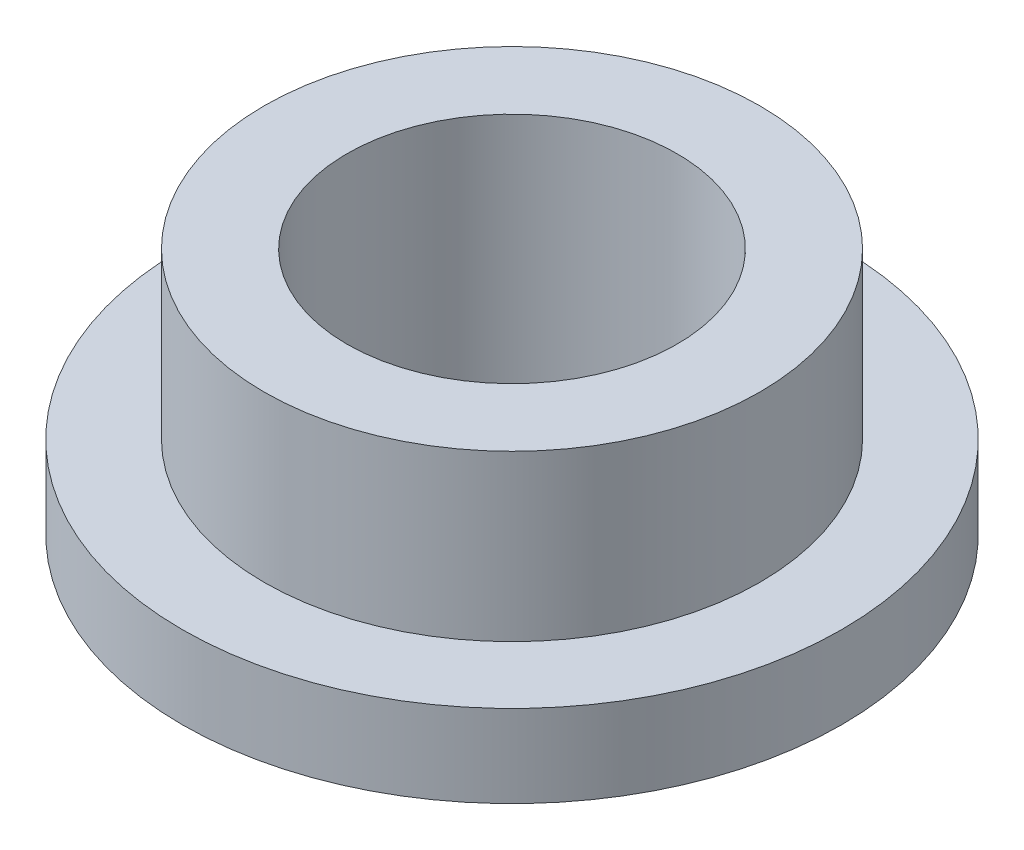
ISO-10303-21;
HEADER;
FILE_DESCRIPTION(('STEP AP214'),'2;1');
FILE_NAME('part.step','',(''),(''),'','','');
FILE_SCHEMA(('AUTOMOTIVE_DESIGN { 1 0 10303 214 1 1 1 1 }'));
ENDSEC;
DATA;
#1=APPLICATION_CONTEXT('core data for automotive mechanical design processes');
#2=APPLICATION_PROTOCOL_DEFINITION('international standard','automotive_design',2000,#1);
#3=PRODUCT_CONTEXT('',#1,'mechanical');
#4=PRODUCT('Part','Part','',(#3));
#5=PRODUCT_RELATED_PRODUCT_CATEGORY('part','',(#4));
#6=PRODUCT_DEFINITION_FORMATION('','',#4);
#7=PRODUCT_DEFINITION_CONTEXT('part definition',#1,'design');
#8=PRODUCT_DEFINITION('design','',#6,#7);
#9=PRODUCT_DEFINITION_SHAPE('','',#8);
#10=(LENGTH_UNIT() NAMED_UNIT(*) SI_UNIT(.MILLI.,.METRE.));
#11=(NAMED_UNIT(*) PLANE_ANGLE_UNIT() SI_UNIT($,.RADIAN.));
#12=(NAMED_UNIT(*) SI_UNIT($,.STERADIAN.) SOLID_ANGLE_UNIT());
#13=UNCERTAINTY_MEASURE_WITH_UNIT(LENGTH_MEASURE(1.E-05),#10,'distance_accuracy_value','');
#14=(GEOMETRIC_REPRESENTATION_CONTEXT(3) GLOBAL_UNCERTAINTY_ASSIGNED_CONTEXT((#13)) GLOBAL_UNIT_ASSIGNED_CONTEXT((#10,
#11,#12)) REPRESENTATION_CONTEXT('',''));
#15=CARTESIAN_POINT('',(0.,0.,0.));
#16=DIRECTION('',(0.,0.,1.));
#17=DIRECTION('',(1.,0.,0.));
#18=AXIS2_PLACEMENT_3D('',#15,#16,#17);
#19=CARTESIAN_POINT('',(0.,6.,0.));
#20=DIRECTION('',(0.,1.,0.));
#21=DIRECTION('',(0.,0.,1.));
#22=AXIS2_PLACEMENT_3D('',#19,#20,#21);
#23=PLANE('',#22);
#24=CARTESIAN_POINT('',(0.,6.,0.));
#25=DIRECTION('',(0.,1.,0.));
#26=DIRECTION('',(0.,0.,1.));
#27=AXIS2_PLACEMENT_3D('',#24,#25,#26);
#28=CIRCLE('',#27,6.015);
#29=CARTESIAN_POINT('',(0.,6.,6.015));
#30=VERTEX_POINT('',#29);
#31=EDGE_CURVE('E10',#30,#30,#28,.T.);
#32=ORIENTED_EDGE('',*,*,#31,.T.);
#33=EDGE_LOOP('',(#32));
#34=FACE_BOUND('',#33,.T.);
#35=CARTESIAN_POINT('',(0.,6.,0.));
#36=DIRECTION('',(0.,1.,0.));
#37=DIRECTION('',(0.,0.,1.));
#38=AXIS2_PLACEMENT_3D('',#35,#36,#37);
#39=CIRCLE('',#38,4.005);
#40=CARTESIAN_POINT('',(0.,6.,4.005));
#41=VERTEX_POINT('',#40);
#42=EDGE_CURVE('E37',#41,#41,#39,.T.);
#43=ORIENTED_EDGE('',*,*,#42,.F.);
#44=EDGE_LOOP('',(#43));
#45=FACE_BOUND('',#44,.T.);
#46=ADVANCED_FACE('F30',(#34,#45),#23,.T.);
#47=CARTESIAN_POINT('',(0.,0.,0.));
#48=DIRECTION('',(0.,1.,0.));
#49=DIRECTION('',(0.,0.,1.));
#50=AXIS2_PLACEMENT_3D('',#47,#48,#49);
#51=PLANE('',#50);
#52=CARTESIAN_POINT('',(0.,0.,0.));
#53=DIRECTION('',(0.,1.,0.));
#54=DIRECTION('',(0.,0.,1.));
#55=AXIS2_PLACEMENT_3D('',#52,#53,#54);
#56=CIRCLE('',#55,4.005);
#57=CARTESIAN_POINT('',(0.,0.,4.005));
#58=VERTEX_POINT('',#57);
#59=EDGE_CURVE('E41',#58,#58,#56,.T.);
#60=ORIENTED_EDGE('',*,*,#59,.T.);
#61=EDGE_LOOP('',(#60));
#62=FACE_BOUND('',#61,.T.);
#63=CARTESIAN_POINT('',(0.,0.,0.));
#64=DIRECTION('',(0.,1.,0.));
#65=DIRECTION('',(0.,0.,1.));
#66=AXIS2_PLACEMENT_3D('',#63,#64,#65);
#67=CIRCLE('',#66,8.);
#68=CARTESIAN_POINT('',(0.,0.,8.));
#69=VERTEX_POINT('',#68);
#70=EDGE_CURVE('E48',#69,#69,#67,.T.);
#71=ORIENTED_EDGE('',*,*,#70,.F.);
#72=EDGE_LOOP('',(#71));
#73=FACE_BOUND('',#72,.T.);
#74=ADVANCED_FACE('F73',(#62,#73),#51,.F.);
#75=CARTESIAN_POINT('',(0.,6.,0.));
#76=DIRECTION('',(0.,-1.,0.));
#77=DIRECTION('',(0.,0.,-1.));
#78=AXIS2_PLACEMENT_3D('',#75,#76,#77);
#79=CYLINDRICAL_SURFACE('',#78,6.015);
#80=CARTESIAN_POINT('',(0.,2.,0.));
#81=DIRECTION('',(0.,1.,0.));
#82=DIRECTION('',(0.,0.,1.));
#83=AXIS2_PLACEMENT_3D('',#80,#81,#82);
#84=CIRCLE('',#83,6.015);
#85=CARTESIAN_POINT('',(0.,2.,6.015));
#86=VERTEX_POINT('',#85);
#87=EDGE_CURVE('E51',#86,#86,#84,.T.);
#88=ORIENTED_EDGE('',*,*,#87,.T.);
#89=EDGE_LOOP('',(#88));
#90=FACE_BOUND('',#89,.T.);
#91=ORIENTED_EDGE('',*,*,#31,.F.);
#92=EDGE_LOOP('',(#91));
#93=FACE_BOUND('',#92,.T.);
#94=ADVANCED_FACE('F32',(#90,#93),#79,.T.);
#95=CARTESIAN_POINT('',(0.,6.,0.));
#96=DIRECTION('',(0.,-1.,0.));
#97=DIRECTION('',(0.,0.,-1.));
#98=AXIS2_PLACEMENT_3D('',#95,#96,#97);
#99=CYLINDRICAL_SURFACE('',#98,4.005);
#100=ORIENTED_EDGE('',*,*,#42,.T.);
#101=EDGE_LOOP('',(#100));
#102=FACE_BOUND('',#101,.T.);
#103=ORIENTED_EDGE('',*,*,#59,.F.);
#104=EDGE_LOOP('',(#103));
#105=FACE_BOUND('',#104,.T.);
#106=ADVANCED_FACE('F62',(#102,#105),#99,.F.);
#107=CARTESIAN_POINT('',(0.,2.,0.));
#108=DIRECTION('',(0.,1.,0.));
#109=DIRECTION('',(0.,0.,1.));
#110=AXIS2_PLACEMENT_3D('',#107,#108,#109);
#111=PLANE('',#110);
#112=CARTESIAN_POINT('',(0.,2.,0.));
#113=DIRECTION('',(0.,1.,0.));
#114=DIRECTION('',(0.,0.,1.));
#115=AXIS2_PLACEMENT_3D('',#112,#113,#114);
#116=CIRCLE('',#115,8.);
#117=CARTESIAN_POINT('',(0.,2.,8.));
#118=VERTEX_POINT('',#117);
#119=EDGE_CURVE('E46',#118,#118,#116,.T.);
#120=ORIENTED_EDGE('',*,*,#119,.T.);
#121=EDGE_LOOP('',(#120));
#122=FACE_BOUND('',#121,.T.);
#123=ORIENTED_EDGE('',*,*,#87,.F.);
#124=EDGE_LOOP('',(#123));
#125=FACE_BOUND('',#124,.T.);
#126=ADVANCED_FACE('F59',(#122,#125),#111,.T.);
#127=CARTESIAN_POINT('',(0.,2.,0.));
#128=DIRECTION('',(0.,-1.,0.));
#129=DIRECTION('',(0.,0.,-1.));
#130=AXIS2_PLACEMENT_3D('',#127,#128,#129);
#131=CYLINDRICAL_SURFACE('',#130,8.);
#132=ORIENTED_EDGE('',*,*,#119,.F.);
#133=EDGE_LOOP('',(#132));
#134=FACE_BOUND('',#133,.T.);
#135=ORIENTED_EDGE('',*,*,#70,.T.);
#136=EDGE_LOOP('',(#135));
#137=FACE_BOUND('',#136,.T.);
#138=ADVANCED_FACE('F61',(#134,#137),#131,.T.);
#139=CLOSED_SHELL('',(#46,#74,#94,#106,#126,#138));
#140=MANIFOLD_SOLID_BREP('B2',#139);
#141=ADVANCED_BREP_SHAPE_REPRESENTATION('',(#18,#140),#14);
#142=SHAPE_DEFINITION_REPRESENTATION(#9,#141);
ENDSEC;
END-ISO-10303-21;
